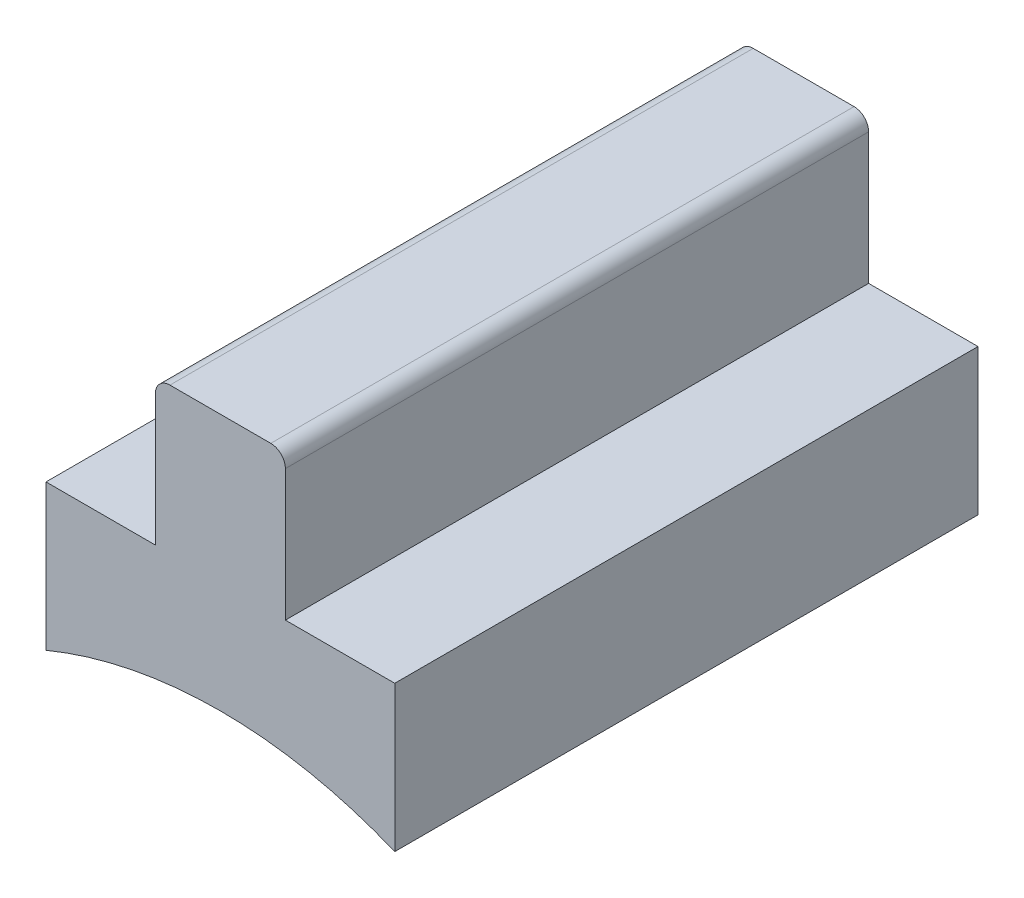
ISO-10303-21;
HEADER;
FILE_DESCRIPTION(('STEP AP214'),'2;1');
FILE_NAME('part.step','',(''),(''),'','','');
FILE_SCHEMA(('AUTOMOTIVE_DESIGN { 1 0 10303 214 1 1 1 1 }'));
ENDSEC;
DATA;
#1=APPLICATION_CONTEXT('core data for automotive mechanical design processes');
#2=APPLICATION_PROTOCOL_DEFINITION('international standard','automotive_design',2000,#1);
#3=PRODUCT_CONTEXT('',#1,'mechanical');
#4=PRODUCT('Part','Part','',(#3));
#5=PRODUCT_RELATED_PRODUCT_CATEGORY('part','',(#4));
#6=PRODUCT_DEFINITION_FORMATION('','',#4);
#7=PRODUCT_DEFINITION_CONTEXT('part definition',#1,'design');
#8=PRODUCT_DEFINITION('design','',#6,#7);
#9=PRODUCT_DEFINITION_SHAPE('','',#8);
#10=(LENGTH_UNIT() NAMED_UNIT(*) SI_UNIT(.MILLI.,.METRE.));
#11=(NAMED_UNIT(*) PLANE_ANGLE_UNIT() SI_UNIT($,.RADIAN.));
#12=(NAMED_UNIT(*) SI_UNIT($,.STERADIAN.) SOLID_ANGLE_UNIT());
#13=UNCERTAINTY_MEASURE_WITH_UNIT(LENGTH_MEASURE(1.E-05),#10,'distance_accuracy_value','');
#14=(GEOMETRIC_REPRESENTATION_CONTEXT(3) GLOBAL_UNCERTAINTY_ASSIGNED_CONTEXT((#13)) GLOBAL_UNIT_ASSIGNED_CONTEXT((#10,
#11,#12)) REPRESENTATION_CONTEXT('',''));
#15=CARTESIAN_POINT('',(0.,0.,0.));
#16=DIRECTION('',(0.,0.,1.));
#17=DIRECTION('',(1.,0.,0.));
#18=AXIS2_PLACEMENT_3D('',#15,#16,#17);
#19=CARTESIAN_POINT('',(8.78549744397905,121.592937893083,101.6));
#20=DIRECTION('',(0.,0.,-1.));
#21=DIRECTION('',(-1.,0.,0.));
#22=AXIS2_PLACEMENT_3D('',#19,#20,#21);
#23=CYLINDRICAL_SURFACE('',#22,2.54);
#24=CARTESIAN_POINT('',(8.78549744397905,121.592937893083,0.));
#25=DIRECTION('',(0.,0.,1.));
#26=DIRECTION('',(1.,0.,0.));
#27=AXIS2_PLACEMENT_3D('',#24,#25,#26);
#28=CIRCLE('',#27,2.54);
#29=CARTESIAN_POINT('',(11.325497443979,121.592937893083,0.));
#30=VERTEX_POINT('',#29);
#31=CARTESIAN_POINT('',(8.78549744397903,124.132937893083,0.));
#32=VERTEX_POINT('',#31);
#33=EDGE_CURVE('E156',#30,#32,#28,.T.);
#34=ORIENTED_EDGE('',*,*,#33,.T.);
#35=DIRECTION('',(0.,0.,-1.));
#36=VECTOR('',#35,1.);
#37=CARTESIAN_POINT('',(8.78549744397903,124.132937893083,101.6));
#38=LINE('',#37,#36);
#39=CARTESIAN_POINT('',(8.78549744397903,124.132937893083,101.6));
#40=VERTEX_POINT('',#39);
#41=EDGE_CURVE('E11',#40,#32,#38,.T.);
#42=ORIENTED_EDGE('',*,*,#41,.F.);
#43=CARTESIAN_POINT('',(8.78549744397905,121.592937893083,101.6));
#44=DIRECTION('',(0.,0.,1.));
#45=DIRECTION('',(1.,0.,0.));
#46=AXIS2_PLACEMENT_3D('',#43,#44,#45);
#47=CIRCLE('',#46,2.54);
#48=CARTESIAN_POINT('',(11.325497443979,121.592937893083,101.6));
#49=VERTEX_POINT('',#48);
#50=EDGE_CURVE('E184',#49,#40,#47,.T.);
#51=ORIENTED_EDGE('',*,*,#50,.F.);
#52=DIRECTION('',(0.,0.,-1.));
#53=VECTOR('',#52,1.);
#54=CARTESIAN_POINT('',(11.325497443979,121.592937893083,101.6));
#55=LINE('',#54,#53);
#56=EDGE_CURVE('E152',#49,#30,#55,.T.);
#57=ORIENTED_EDGE('',*,*,#56,.T.);
#58=EDGE_LOOP('',(#34,#42,#51,#57));
#59=FACE_BOUND('',#58,.T.);
#60=ADVANCED_FACE('F43',(#59),#23,.T.);
#61=CARTESIAN_POINT('',(-8.78549744397903,124.132937893083,101.6));
#62=DIRECTION('',(0.,-1.,0.));
#63=DIRECTION('',(0.,0.,-1.));
#64=AXIS2_PLACEMENT_3D('',#61,#62,#63);
#65=PLANE('',#64);
#66=DIRECTION('',(-1.,0.,0.));
#67=VECTOR('',#66,1.);
#68=CARTESIAN_POINT('',(-8.78549744397903,124.132937893083,0.));
#69=LINE('',#68,#67);
#70=CARTESIAN_POINT('',(-8.78549744397903,124.132937893083,0.));
#71=VERTEX_POINT('',#70);
#72=EDGE_CURVE('E160',#32,#71,#69,.T.);
#73=ORIENTED_EDGE('',*,*,#72,.T.);
#74=DIRECTION('',(0.,0.,-1.));
#75=VECTOR('',#74,1.);
#76=CARTESIAN_POINT('',(-8.78549744397903,124.132937893083,101.6));
#77=LINE('',#76,#75);
#78=CARTESIAN_POINT('',(-8.78549744397903,124.132937893083,101.6));
#79=VERTEX_POINT('',#78);
#80=EDGE_CURVE('E52',#79,#71,#77,.T.);
#81=ORIENTED_EDGE('',*,*,#80,.F.);
#82=DIRECTION('',(-1.,0.,0.));
#83=VECTOR('',#82,1.);
#84=CARTESIAN_POINT('',(-8.78549744397903,124.132937893083,101.6));
#85=LINE('',#84,#83);
#86=EDGE_CURVE('E109',#40,#79,#85,.T.);
#87=ORIENTED_EDGE('',*,*,#86,.F.);
#88=ORIENTED_EDGE('',*,*,#41,.T.);
#89=EDGE_LOOP('',(#73,#81,#87,#88));
#90=FACE_BOUND('',#89,.T.);
#91=ADVANCED_FACE('F248',(#90),#65,.F.);
#92=CARTESIAN_POINT('',(-8.78549744397905,121.592937893083,101.6));
#93=DIRECTION('',(0.,0.,-1.));
#94=DIRECTION('',(-1.,0.,0.));
#95=AXIS2_PLACEMENT_3D('',#92,#93,#94);
#96=CYLINDRICAL_SURFACE('',#95,2.54);
#97=CARTESIAN_POINT('',(-8.78549744397905,121.592937893083,0.));
#98=DIRECTION('',(0.,0.,1.));
#99=DIRECTION('',(-1.,0.,0.));
#100=AXIS2_PLACEMENT_3D('',#97,#98,#99);
#101=CIRCLE('',#100,2.54);
#102=CARTESIAN_POINT('',(-11.325497443979,121.592937893083,0.));
#103=VERTEX_POINT('',#102);
#104=EDGE_CURVE('E163',#71,#103,#101,.T.);
#105=ORIENTED_EDGE('',*,*,#104,.T.);
#106=DIRECTION('',(0.,0.,-1.));
#107=VECTOR('',#106,1.);
#108=CARTESIAN_POINT('',(-11.325497443979,121.592937893083,101.6));
#109=LINE('',#108,#107);
#110=CARTESIAN_POINT('',(-11.325497443979,121.592937893083,101.6));
#111=VERTEX_POINT('',#110);
#112=EDGE_CURVE('E203',#111,#103,#109,.T.);
#113=ORIENTED_EDGE('',*,*,#112,.F.);
#114=CARTESIAN_POINT('',(-8.78549744397905,121.592937893083,101.6));
#115=DIRECTION('',(0.,0.,1.));
#116=DIRECTION('',(-1.,0.,0.));
#117=AXIS2_PLACEMENT_3D('',#114,#115,#116);
#118=CIRCLE('',#117,2.54);
#119=EDGE_CURVE('E213',#79,#111,#118,.T.);
#120=ORIENTED_EDGE('',*,*,#119,.F.);
#121=ORIENTED_EDGE('',*,*,#80,.T.);
#122=EDGE_LOOP('',(#105,#113,#120,#121));
#123=FACE_BOUND('',#122,.T.);
#124=ADVANCED_FACE('F211',(#123),#96,.T.);
#125=CARTESIAN_POINT('',(-11.325497443979,98.7329378930834,101.6));
#126=DIRECTION('',(1.,0.,0.));
#127=DIRECTION('',(0.,0.,-1.));
#128=AXIS2_PLACEMENT_3D('',#125,#126,#127);
#129=PLANE('',#128);
#130=DIRECTION('',(0.,-1.,0.));
#131=VECTOR('',#130,1.);
#132=CARTESIAN_POINT('',(-11.325497443979,98.7329378930834,0.));
#133=LINE('',#132,#131);
#134=CARTESIAN_POINT('',(-11.325497443979,98.7329378930834,0.));
#135=VERTEX_POINT('',#134);
#136=EDGE_CURVE('E166',#103,#135,#133,.T.);
#137=ORIENTED_EDGE('',*,*,#136,.T.);
#138=DIRECTION('',(0.,0.,-1.));
#139=VECTOR('',#138,1.);
#140=CARTESIAN_POINT('',(-11.325497443979,98.7329378930834,101.6));
#141=LINE('',#140,#139);
#142=CARTESIAN_POINT('',(-11.325497443979,98.7329378930834,101.6));
#143=VERTEX_POINT('',#142);
#144=EDGE_CURVE('E199',#143,#135,#141,.T.);
#145=ORIENTED_EDGE('',*,*,#144,.F.);
#146=DIRECTION('',(0.,-1.,0.));
#147=VECTOR('',#146,1.);
#148=CARTESIAN_POINT('',(-11.325497443979,98.7329378930834,101.6));
#149=LINE('',#148,#147);
#150=EDGE_CURVE('E232',#111,#143,#149,.T.);
#151=ORIENTED_EDGE('',*,*,#150,.F.);
#152=ORIENTED_EDGE('',*,*,#112,.T.);
#153=EDGE_LOOP('',(#137,#145,#151,#152));
#154=FACE_BOUND('',#153,.T.);
#155=ADVANCED_FACE('F222',(#154),#129,.F.);
#156=CARTESIAN_POINT('',(-30.3754974439791,98.7329378930834,101.6));
#157=DIRECTION('',(0.,-1.,0.));
#158=DIRECTION('',(0.,0.,-1.));
#159=AXIS2_PLACEMENT_3D('',#156,#157,#158);
#160=PLANE('',#159);
#161=DIRECTION('',(-1.,0.,0.));
#162=VECTOR('',#161,1.);
#163=CARTESIAN_POINT('',(-30.3754974439791,98.7329378930834,0.));
#164=LINE('',#163,#162);
#165=CARTESIAN_POINT('',(-30.3754974439791,98.7329378930834,0.));
#166=VERTEX_POINT('',#165);
#167=EDGE_CURVE('E169',#135,#166,#164,.T.);
#168=ORIENTED_EDGE('',*,*,#167,.T.);
#169=DIRECTION('',(0.,0.,-1.));
#170=VECTOR('',#169,1.);
#171=CARTESIAN_POINT('',(-30.3754974439791,98.7329378930834,101.6));
#172=LINE('',#171,#170);
#173=CARTESIAN_POINT('',(-30.3754974439791,98.7329378930834,101.6));
#174=VERTEX_POINT('',#173);
#175=EDGE_CURVE('E195',#174,#166,#172,.T.);
#176=ORIENTED_EDGE('',*,*,#175,.F.);
#177=DIRECTION('',(-1.,0.,0.));
#178=VECTOR('',#177,1.);
#179=CARTESIAN_POINT('',(-30.3754974439791,98.7329378930834,101.6));
#180=LINE('',#179,#178);
#181=EDGE_CURVE('E228',#143,#174,#180,.T.);
#182=ORIENTED_EDGE('',*,*,#181,.F.);
#183=ORIENTED_EDGE('',*,*,#144,.T.);
#184=EDGE_LOOP('',(#168,#176,#182,#183));
#185=FACE_BOUND('',#184,.T.);
#186=ADVANCED_FACE('F226',(#185),#160,.F.);
#187=CARTESIAN_POINT('',(-30.3754974439791,73.3329378930834,101.6));
#188=DIRECTION('',(1.,0.,0.));
#189=DIRECTION('',(0.,0.,-1.));
#190=AXIS2_PLACEMENT_3D('',#187,#188,#189);
#191=PLANE('',#190);
#192=DIRECTION('',(0.,-1.,0.));
#193=VECTOR('',#192,1.);
#194=CARTESIAN_POINT('',(-30.3754974439791,73.3329378930834,0.));
#195=LINE('',#194,#193);
#196=CARTESIAN_POINT('',(-30.3754974439791,73.3329378930834,0.));
#197=VERTEX_POINT('',#196);
#198=EDGE_CURVE('E172',#166,#197,#195,.T.);
#199=ORIENTED_EDGE('',*,*,#198,.T.);
#200=DIRECTION('',(0.,0.,-1.));
#201=VECTOR('',#200,1.);
#202=CARTESIAN_POINT('',(-30.3754974439791,73.3329378930834,101.6));
#203=LINE('',#202,#201);
#204=CARTESIAN_POINT('',(-30.3754974439791,73.3329378930834,101.6));
#205=VERTEX_POINT('',#204);
#206=EDGE_CURVE('E191',#205,#197,#203,.T.);
#207=ORIENTED_EDGE('',*,*,#206,.F.);
#208=DIRECTION('',(0.,-1.,0.));
#209=VECTOR('',#208,1.);
#210=CARTESIAN_POINT('',(-30.3754974439791,73.3329378930834,101.6));
#211=LINE('',#210,#209);
#212=EDGE_CURVE('E231',#174,#205,#211,.T.);
#213=ORIENTED_EDGE('',*,*,#212,.F.);
#214=ORIENTED_EDGE('',*,*,#175,.T.);
#215=EDGE_LOOP('',(#199,#207,#213,#214));
#216=FACE_BOUND('',#215,.T.);
#217=ADVANCED_FACE('F260',(#216),#191,.F.);
#218=CARTESIAN_POINT('',(0.,0.,101.6));
#219=DIRECTION('',(0.,0.,-1.));
#220=DIRECTION('',(-1.,0.,0.));
#221=AXIS2_PLACEMENT_3D('',#218,#219,#220);
#222=CYLINDRICAL_SURFACE('',#221,79.375);
#223=CARTESIAN_POINT('',(0.,0.,0.));
#224=DIRECTION('',(0.,0.,-1.));
#225=DIRECTION('',(1.,0.,0.));
#226=AXIS2_PLACEMENT_3D('',#223,#224,#225);
#227=CIRCLE('',#226,79.375);
#228=CARTESIAN_POINT('',(30.3754974439791,73.3329378930834,0.));
#229=VERTEX_POINT('',#228);
#230=EDGE_CURVE('E175',#197,#229,#227,.T.);
#231=ORIENTED_EDGE('',*,*,#230,.T.);
#232=DIRECTION('',(0.,0.,-1.));
#233=VECTOR('',#232,1.);
#234=CARTESIAN_POINT('',(30.3754974439791,73.3329378930834,101.6));
#235=LINE('',#234,#233);
#236=CARTESIAN_POINT('',(30.3754974439791,73.3329378930834,101.6));
#237=VERTEX_POINT('',#236);
#238=EDGE_CURVE('E145',#237,#229,#235,.T.);
#239=ORIENTED_EDGE('',*,*,#238,.F.);
#240=CARTESIAN_POINT('',(0.,0.,101.6));
#241=DIRECTION('',(0.,0.,-1.));
#242=DIRECTION('',(1.,0.,0.));
#243=AXIS2_PLACEMENT_3D('',#240,#241,#242);
#244=CIRCLE('',#243,79.375);
#245=EDGE_CURVE('E134',#205,#237,#244,.T.);
#246=ORIENTED_EDGE('',*,*,#245,.F.);
#247=ORIENTED_EDGE('',*,*,#206,.T.);
#248=EDGE_LOOP('',(#231,#239,#246,#247));
#249=FACE_BOUND('',#248,.T.);
#250=ADVANCED_FACE('F263',(#249),#222,.F.);
#251=CARTESIAN_POINT('',(30.3754974439791,73.3329378930834,101.6));
#252=DIRECTION('',(-1.,0.,0.));
#253=DIRECTION('',(0.,-1.,0.));
#254=AXIS2_PLACEMENT_3D('',#251,#252,#253);
#255=PLANE('',#254);
#256=DIRECTION('',(0.,1.,0.));
#257=VECTOR('',#256,1.);
#258=CARTESIAN_POINT('',(30.3754974439791,73.3329378930834,0.));
#259=LINE('',#258,#257);
#260=CARTESIAN_POINT('',(30.3754974439791,98.7329378930834,0.));
#261=VERTEX_POINT('',#260);
#262=EDGE_CURVE('E143',#229,#261,#259,.T.);
#263=ORIENTED_EDGE('',*,*,#262,.T.);
#264=DIRECTION('',(0.,0.,-1.));
#265=VECTOR('',#264,1.);
#266=CARTESIAN_POINT('',(30.3754974439791,98.7329378930834,101.6));
#267=LINE('',#266,#265);
#268=CARTESIAN_POINT('',(30.3754974439791,98.7329378930834,101.6));
#269=VERTEX_POINT('',#268);
#270=EDGE_CURVE('E140',#269,#261,#267,.T.);
#271=ORIENTED_EDGE('',*,*,#270,.F.);
#272=DIRECTION('',(0.,1.,0.));
#273=VECTOR('',#272,1.);
#274=CARTESIAN_POINT('',(30.3754974439791,73.3329378930834,101.6));
#275=LINE('',#274,#273);
#276=EDGE_CURVE('E128',#237,#269,#275,.T.);
#277=ORIENTED_EDGE('',*,*,#276,.F.);
#278=ORIENTED_EDGE('',*,*,#238,.T.);
#279=EDGE_LOOP('',(#263,#271,#277,#278));
#280=FACE_BOUND('',#279,.T.);
#281=ADVANCED_FACE('F141',(#280),#255,.F.);
#282=CARTESIAN_POINT('',(30.3754974439791,98.7329378930834,101.6));
#283=DIRECTION('',(0.,-1.,0.));
#284=DIRECTION('',(0.,0.,-1.));
#285=AXIS2_PLACEMENT_3D('',#282,#283,#284);
#286=PLANE('',#285);
#287=DIRECTION('',(-1.,0.,0.));
#288=VECTOR('',#287,1.);
#289=CARTESIAN_POINT('',(30.3754974439791,98.7329378930834,0.));
#290=LINE('',#289,#288);
#291=CARTESIAN_POINT('',(11.325497443979,98.7329378930834,0.));
#292=VERTEX_POINT('',#291);
#293=EDGE_CURVE('E95',#261,#292,#290,.T.);
#294=ORIENTED_EDGE('',*,*,#293,.T.);
#295=DIRECTION('',(0.,0.,-1.));
#296=VECTOR('',#295,1.);
#297=CARTESIAN_POINT('',(11.325497443979,98.7329378930834,101.6));
#298=LINE('',#297,#296);
#299=CARTESIAN_POINT('',(11.325497443979,98.7329378930834,101.6));
#300=VERTEX_POINT('',#299);
#301=EDGE_CURVE('E146',#300,#292,#298,.T.);
#302=ORIENTED_EDGE('',*,*,#301,.F.);
#303=DIRECTION('',(-1.,0.,0.));
#304=VECTOR('',#303,1.);
#305=CARTESIAN_POINT('',(30.3754974439791,98.7329378930834,101.6));
#306=LINE('',#305,#304);
#307=EDGE_CURVE('E132',#269,#300,#306,.T.);
#308=ORIENTED_EDGE('',*,*,#307,.F.);
#309=ORIENTED_EDGE('',*,*,#270,.T.);
#310=EDGE_LOOP('',(#294,#302,#308,#309));
#311=FACE_BOUND('',#310,.T.);
#312=ADVANCED_FACE('F148',(#311),#286,.F.);
#313=CARTESIAN_POINT('',(11.325497443979,98.7329378930834,101.6));
#314=DIRECTION('',(-1.,0.,0.));
#315=DIRECTION('',(0.,0.,1.));
#316=AXIS2_PLACEMENT_3D('',#313,#314,#315);
#317=PLANE('',#316);
#318=DIRECTION('',(0.,1.,0.));
#319=VECTOR('',#318,1.);
#320=CARTESIAN_POINT('',(11.325497443979,98.7329378930834,0.));
#321=LINE('',#320,#319);
#322=EDGE_CURVE('E101',#292,#30,#321,.T.);
#323=ORIENTED_EDGE('',*,*,#322,.T.);
#324=ORIENTED_EDGE('',*,*,#56,.F.);
#325=DIRECTION('',(0.,1.,0.));
#326=VECTOR('',#325,1.);
#327=CARTESIAN_POINT('',(11.325497443979,98.7329378930834,101.6));
#328=LINE('',#327,#326);
#329=EDGE_CURVE('E60',#300,#49,#328,.T.);
#330=ORIENTED_EDGE('',*,*,#329,.F.);
#331=ORIENTED_EDGE('',*,*,#301,.T.);
#332=EDGE_LOOP('',(#323,#324,#330,#331));
#333=FACE_BOUND('',#332,.T.);
#334=ADVANCED_FACE('F272',(#333),#317,.F.);
#335=CARTESIAN_POINT('',(8.78549744397905,121.592937893083,101.6));
#336=DIRECTION('',(0.,0.,1.));
#337=DIRECTION('',(1.,0.,0.));
#338=AXIS2_PLACEMENT_3D('',#335,#336,#337);
#339=PLANE('',#338);
#340=ORIENTED_EDGE('',*,*,#50,.T.);
#341=ORIENTED_EDGE('',*,*,#86,.T.);
#342=ORIENTED_EDGE('',*,*,#119,.T.);
#343=ORIENTED_EDGE('',*,*,#150,.T.);
#344=ORIENTED_EDGE('',*,*,#181,.T.);
#345=ORIENTED_EDGE('',*,*,#212,.T.);
#346=ORIENTED_EDGE('',*,*,#245,.T.);
#347=ORIENTED_EDGE('',*,*,#276,.T.);
#348=ORIENTED_EDGE('',*,*,#307,.T.);
#349=ORIENTED_EDGE('',*,*,#329,.T.);
#350=EDGE_LOOP('',(#340,#341,#342,#343,#344,#345,#346,#347,#348,#349));
#351=FACE_BOUND('',#350,.T.);
#352=ADVANCED_FACE('F130',(#351),#339,.T.);
#353=CARTESIAN_POINT('',(8.78549744397905,121.592937893083,0.));
#354=DIRECTION('',(0.,0.,1.));
#355=DIRECTION('',(1.,0.,0.));
#356=AXIS2_PLACEMENT_3D('',#353,#354,#355);
#357=PLANE('',#356);
#358=ORIENTED_EDGE('',*,*,#33,.F.);
#359=ORIENTED_EDGE('',*,*,#322,.F.);
#360=ORIENTED_EDGE('',*,*,#293,.F.);
#361=ORIENTED_EDGE('',*,*,#262,.F.);
#362=ORIENTED_EDGE('',*,*,#230,.F.);
#363=ORIENTED_EDGE('',*,*,#198,.F.);
#364=ORIENTED_EDGE('',*,*,#167,.F.);
#365=ORIENTED_EDGE('',*,*,#136,.F.);
#366=ORIENTED_EDGE('',*,*,#104,.F.);
#367=ORIENTED_EDGE('',*,*,#72,.F.);
#368=EDGE_LOOP('',(#358,#359,#360,#361,#362,#363,#364,#365,#366,#367));
#369=FACE_BOUND('',#368,.T.);
#370=ADVANCED_FACE('F217',(#369),#357,.F.);
#371=CLOSED_SHELL('',(#60,#91,#124,#155,#186,#217,#250,#281,#312,#334,#352,#370));
#372=MANIFOLD_SOLID_BREP('B2',#371);
#373=ADVANCED_BREP_SHAPE_REPRESENTATION('',(#18,#372),#14);
#374=SHAPE_DEFINITION_REPRESENTATION(#9,#373);
ENDSEC;
END-ISO-10303-21;
